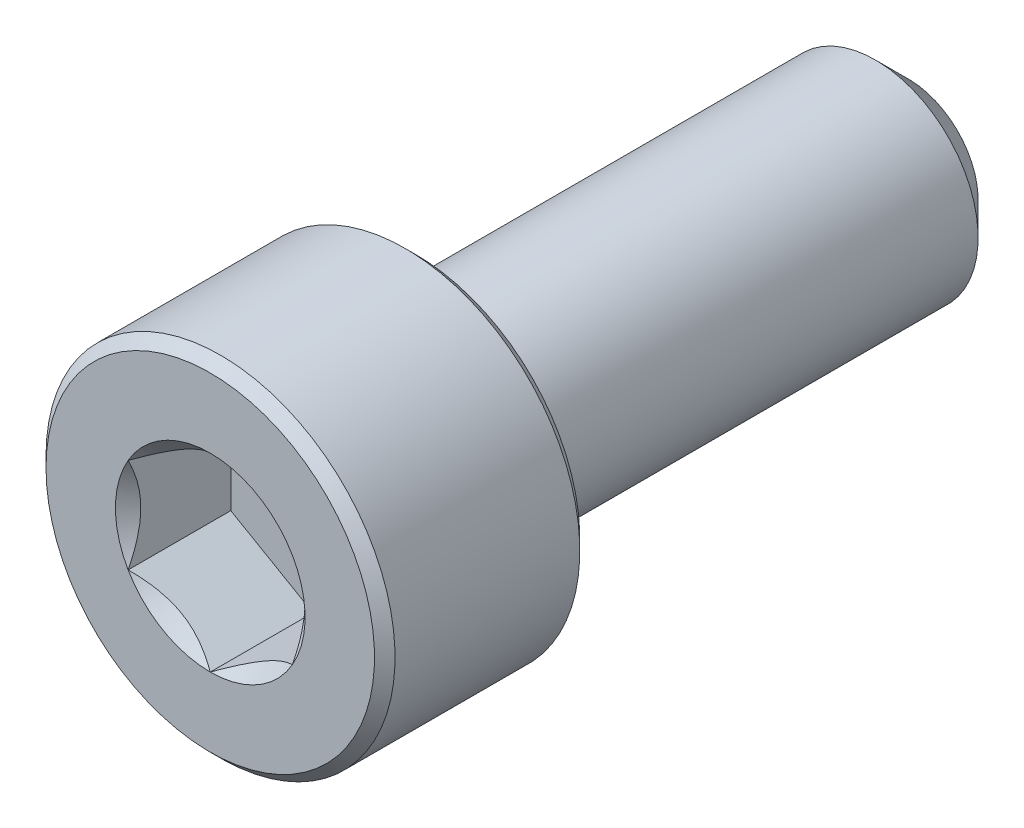
ISO-10303-21;
HEADER;
FILE_DESCRIPTION(('STEP AP214'),'2;1');
FILE_NAME('part.step','',(''),(''),'','','');
FILE_SCHEMA(('AUTOMOTIVE_DESIGN { 1 0 10303 214 1 1 1 1 }'));
ENDSEC;
DATA;
#1=APPLICATION_CONTEXT('core data for automotive mechanical design processes');
#2=APPLICATION_PROTOCOL_DEFINITION('international standard','automotive_design',2000,#1);
#3=PRODUCT_CONTEXT('',#1,'mechanical');
#4=PRODUCT('Part','Part','',(#3));
#5=PRODUCT_RELATED_PRODUCT_CATEGORY('part','',(#4));
#6=PRODUCT_DEFINITION_FORMATION('','',#4);
#7=PRODUCT_DEFINITION_CONTEXT('part definition',#1,'design');
#8=PRODUCT_DEFINITION('design','',#6,#7);
#9=PRODUCT_DEFINITION_SHAPE('','',#8);
#10=(LENGTH_UNIT() NAMED_UNIT(*) SI_UNIT(.MILLI.,.METRE.));
#11=(NAMED_UNIT(*) PLANE_ANGLE_UNIT() SI_UNIT($,.RADIAN.));
#12=(NAMED_UNIT(*) SI_UNIT($,.STERADIAN.) SOLID_ANGLE_UNIT());
#13=UNCERTAINTY_MEASURE_WITH_UNIT(LENGTH_MEASURE(1.E-05),#10,'distance_accuracy_value','');
#14=(GEOMETRIC_REPRESENTATION_CONTEXT(3) GLOBAL_UNCERTAINTY_ASSIGNED_CONTEXT((#13)) GLOBAL_UNIT_ASSIGNED_CONTEXT((#10,
#11,#12)) REPRESENTATION_CONTEXT('',''));
#15=CARTESIAN_POINT('',(0.,0.,0.));
#16=DIRECTION('',(0.,0.,1.));
#17=DIRECTION('',(1.,0.,0.));
#18=AXIS2_PLACEMENT_3D('',#15,#16,#17);
#19=CARTESIAN_POINT('',(0.,4.,8.5));
#20=DIRECTION('',(0.,0.,1.));
#21=DIRECTION('',(1.,0.,0.));
#22=AXIS2_PLACEMENT_3D('',#19,#20,#21);
#23=PLANE('',#22);
#24=CARTESIAN_POINT('',(0.,0.,8.5));
#25=DIRECTION('',(0.,0.,1.));
#26=DIRECTION('',(1.,0.,0.));
#27=AXIS2_PLACEMENT_3D('',#24,#25,#26);
#28=CIRCLE('',#27,2.3094010767585);
#29=CARTESIAN_POINT('',(2.,1.15470053837925,8.5));
#30=VERTEX_POINT('',#29);
#31=CARTESIAN_POINT('',(0.,2.3094010767585,8.5));
#32=VERTEX_POINT('',#31);
#33=EDGE_CURVE('E92',#30,#32,#28,.T.);
#34=ORIENTED_EDGE('',*,*,#33,.F.);
#35=CARTESIAN_POINT('',(2.,-1.15470053837925,8.5));
#36=VERTEX_POINT('',#35);
#37=EDGE_CURVE('E52',#36,#30,#28,.T.);
#38=ORIENTED_EDGE('',*,*,#37,.F.);
#39=CARTESIAN_POINT('',(0.,-2.3094010767585,8.5));
#40=VERTEX_POINT('',#39);
#41=EDGE_CURVE('E278',#40,#36,#28,.T.);
#42=ORIENTED_EDGE('',*,*,#41,.F.);
#43=CARTESIAN_POINT('',(-2.,-1.15470053837925,8.5));
#44=VERTEX_POINT('',#43);
#45=EDGE_CURVE('E59',#44,#40,#28,.T.);
#46=ORIENTED_EDGE('',*,*,#45,.F.);
#47=CARTESIAN_POINT('',(-2.,1.15470053837925,8.5));
#48=VERTEX_POINT('',#47);
#49=EDGE_CURVE('E128',#48,#44,#28,.T.);
#50=ORIENTED_EDGE('',*,*,#49,.F.);
#51=EDGE_CURVE('E101',#32,#48,#28,.T.);
#52=ORIENTED_EDGE('',*,*,#51,.F.);
#53=EDGE_LOOP('',(#34,#38,#42,#46,#50,#52));
#54=FACE_BOUND('',#53,.T.);
#55=CARTESIAN_POINT('',(0.,0.,8.5));
#56=DIRECTION('',(0.,0.,-1.));
#57=DIRECTION('',(-1.,0.,0.));
#58=AXIS2_PLACEMENT_3D('',#55,#56,#57);
#59=CIRCLE('',#58,4.);
#60=CARTESIAN_POINT('',(-4.,0.,8.5));
#61=VERTEX_POINT('',#60);
#62=EDGE_CURVE('E46',#61,#61,#59,.T.);
#63=ORIENTED_EDGE('',*,*,#62,.F.);
#64=EDGE_LOOP('',(#63));
#65=FACE_BOUND('',#64,.T.);
#66=ADVANCED_FACE('F33',(#54,#65),#23,.T.);
#67=CARTESIAN_POINT('',(0.,0.,8.25));
#68=DIRECTION('',(0.,0.,-1.));
#69=DIRECTION('',(-1.,0.,0.));
#70=AXIS2_PLACEMENT_3D('',#67,#68,#69);
#71=CONICAL_SURFACE('',#70,4.25,0.785398163397448);
#72=ORIENTED_EDGE('',*,*,#62,.T.);
#73=EDGE_LOOP('',(#72));
#74=FACE_BOUND('',#73,.T.);
#75=CARTESIAN_POINT('',(0.,0.,8.25));
#76=DIRECTION('',(0.,0.,-1.));
#77=DIRECTION('',(-1.,0.,0.));
#78=AXIS2_PLACEMENT_3D('',#75,#76,#77);
#79=CIRCLE('',#78,4.25);
#80=CARTESIAN_POINT('',(-4.25,0.,8.25));
#81=VERTEX_POINT('',#80);
#82=EDGE_CURVE('E212',#81,#81,#79,.T.);
#83=ORIENTED_EDGE('',*,*,#82,.F.);
#84=EDGE_LOOP('',(#83));
#85=FACE_BOUND('',#84,.T.);
#86=ADVANCED_FACE('F217',(#74,#85),#71,.T.);
#87=CARTESIAN_POINT('',(0.,0.,-8.5));
#88=DIRECTION('',(0.,0.,-1.));
#89=DIRECTION('',(-1.,0.,0.));
#90=AXIS2_PLACEMENT_3D('',#87,#88,#89);
#91=CYLINDRICAL_SURFACE('',#90,4.25);
#92=ORIENTED_EDGE('',*,*,#82,.T.);
#93=EDGE_LOOP('',(#92));
#94=FACE_BOUND('',#93,.T.);
#95=CARTESIAN_POINT('',(0.,0.,3.75));
#96=DIRECTION('',(0.,0.,-1.));
#97=DIRECTION('',(-1.,0.,0.));
#98=AXIS2_PLACEMENT_3D('',#95,#96,#97);
#99=CIRCLE('',#98,4.25);
#100=CARTESIAN_POINT('',(-4.25,0.,3.75));
#101=VERTEX_POINT('',#100);
#102=EDGE_CURVE('E209',#101,#101,#99,.T.);
#103=ORIENTED_EDGE('',*,*,#102,.F.);
#104=EDGE_LOOP('',(#103));
#105=FACE_BOUND('',#104,.T.);
#106=ADVANCED_FACE('F223',(#94,#105),#91,.T.);
#107=CARTESIAN_POINT('',(0.,0.,3.5));
#108=DIRECTION('',(0.,0.,1.));
#109=DIRECTION('',(1.,0.,0.));
#110=AXIS2_PLACEMENT_3D('',#107,#108,#109);
#111=CONICAL_SURFACE('',#110,4.,0.785398163397448);
#112=ORIENTED_EDGE('',*,*,#102,.T.);
#113=EDGE_LOOP('',(#112));
#114=FACE_BOUND('',#113,.T.);
#115=CARTESIAN_POINT('',(0.,0.,3.5));
#116=DIRECTION('',(0.,0.,-1.));
#117=DIRECTION('',(-1.,0.,0.));
#118=AXIS2_PLACEMENT_3D('',#115,#116,#117);
#119=CIRCLE('',#118,4.);
#120=CARTESIAN_POINT('',(-4.,0.,3.5));
#121=VERTEX_POINT('',#120);
#122=EDGE_CURVE('E206',#121,#121,#119,.T.);
#123=ORIENTED_EDGE('',*,*,#122,.F.);
#124=EDGE_LOOP('',(#123));
#125=FACE_BOUND('',#124,.T.);
#126=ADVANCED_FACE('F227',(#114,#125),#111,.T.);
#127=CARTESIAN_POINT('',(0.,4.,3.5));
#128=DIRECTION('',(0.,0.,-1.));
#129=DIRECTION('',(-1.,0.,0.));
#130=AXIS2_PLACEMENT_3D('',#127,#128,#129);
#131=PLANE('',#130);
#132=ORIENTED_EDGE('',*,*,#122,.T.);
#133=EDGE_LOOP('',(#132));
#134=FACE_BOUND('',#133,.T.);
#135=CARTESIAN_POINT('',(0.,0.,3.5));
#136=DIRECTION('',(0.,0.,-1.));
#137=DIRECTION('',(-1.,0.,0.));
#138=AXIS2_PLACEMENT_3D('',#135,#136,#137);
#139=CIRCLE('',#138,2.5);
#140=CARTESIAN_POINT('',(-2.5,0.,3.5));
#141=VERTEX_POINT('',#140);
#142=EDGE_CURVE('E203',#141,#141,#139,.T.);
#143=ORIENTED_EDGE('',*,*,#142,.F.);
#144=EDGE_LOOP('',(#143));
#145=FACE_BOUND('',#144,.T.);
#146=ADVANCED_FACE('F233',(#134,#145),#131,.T.);
#147=CARTESIAN_POINT('',(0.,0.,-8.5));
#148=DIRECTION('',(0.,0.,-1.));
#149=DIRECTION('',(-1.,0.,0.));
#150=AXIS2_PLACEMENT_3D('',#147,#148,#149);
#151=CYLINDRICAL_SURFACE('',#150,2.5);
#152=ORIENTED_EDGE('',*,*,#142,.T.);
#153=EDGE_LOOP('',(#152));
#154=FACE_BOUND('',#153,.T.);
#155=CARTESIAN_POINT('',(0.,0.,-7.69999999999999));
#156=DIRECTION('',(0.,0.,-1.));
#157=DIRECTION('',(-1.,0.,0.));
#158=AXIS2_PLACEMENT_3D('',#155,#156,#157);
#159=CIRCLE('',#158,2.5);
#160=CARTESIAN_POINT('',(-2.5,0.,-7.69999999999999));
#161=VERTEX_POINT('',#160);
#162=EDGE_CURVE('E200',#161,#161,#159,.T.);
#163=ORIENTED_EDGE('',*,*,#162,.F.);
#164=EDGE_LOOP('',(#163));
#165=FACE_BOUND('',#164,.T.);
#166=ADVANCED_FACE('F237',(#154,#165),#151,.T.);
#167=CARTESIAN_POINT('',(0.,0.,-8.5));
#168=DIRECTION('',(0.,0.,1.));
#169=DIRECTION('',(1.,0.,0.));
#170=AXIS2_PLACEMENT_3D('',#167,#168,#169);
#171=CONICAL_SURFACE('',#170,1.7,0.785398163397444);
#172=ORIENTED_EDGE('',*,*,#162,.T.);
#173=EDGE_LOOP('',(#172));
#174=FACE_BOUND('',#173,.T.);
#175=CARTESIAN_POINT('',(0.,0.,-8.5));
#176=DIRECTION('',(0.,0.,-1.));
#177=DIRECTION('',(-1.,0.,0.));
#178=AXIS2_PLACEMENT_3D('',#175,#176,#177);
#179=CIRCLE('',#178,1.7);
#180=CARTESIAN_POINT('',(-1.7,0.,-8.5));
#181=VERTEX_POINT('',#180);
#182=EDGE_CURVE('E188',#181,#181,#179,.T.);
#183=ORIENTED_EDGE('',*,*,#182,.F.);
#184=EDGE_LOOP('',(#183));
#185=FACE_BOUND('',#184,.T.);
#186=ADVANCED_FACE('F240',(#174,#185),#171,.T.);
#187=CARTESIAN_POINT('',(0.,1.7,-8.5));
#188=DIRECTION('',(0.,0.,-1.));
#189=DIRECTION('',(-1.,0.,0.));
#190=AXIS2_PLACEMENT_3D('',#187,#188,#189);
#191=PLANE('',#190);
#192=ORIENTED_EDGE('',*,*,#182,.T.);
#193=EDGE_LOOP('',(#192));
#194=FACE_BOUND('',#193,.T.);
#195=ADVANCED_FACE('F161',(#194),#191,.T.);
#196=CARTESIAN_POINT('',(0.,0.,8.5));
#197=DIRECTION('',(0.,0.,1.));
#198=DIRECTION('',(1.,0.,0.));
#199=AXIS2_PLACEMENT_3D('',#196,#197,#198);
#200=CONICAL_SURFACE('',#199,2.3094010767585,0.78539816339745);
#201=ORIENTED_EDGE('',*,*,#51,.T.);
#202=CARTESIAN_POINT('',(0.000200000000000219,2.30951654681234,8.50011547871366));
#203=CARTESIAN_POINT('',(-0.0685530340307051,2.26982196410711,8.46045309022559));
#204=CARTESIAN_POINT('',(-0.138455742135511,2.22946361676572,8.42311998228416));
#205=CARTESIAN_POINT('',(-0.280995244550436,2.14716839667631,8.35476368513615));
#206=CARTESIAN_POINT('',(-0.353645597565358,2.10522369580642,8.32377853373722));
#207=CARTESIAN_POINT('',(-0.500141601053971,2.02064418875706,8.27070021654414));
#208=CARTESIAN_POINT('',(-0.573949935246294,1.97803092714269,8.24847362717661));
#209=CARTESIAN_POINT('',(-0.723191631835264,1.89186619344273,8.21422881667508));
#210=CARTESIAN_POINT('',(-0.798620433918152,1.84831735425552,8.20218502914414));
#211=CARTESIAN_POINT('',(-0.928615500671079,1.7732646674724,8.19131851190557));
#212=CARTESIAN_POINT('',(-0.983013783970109,1.74185780396625,8.18970975360997));
#213=CARTESIAN_POINT('',(-1.09172145551969,1.67909540053412,8.19241887759871));
#214=CARTESIAN_POINT('',(-1.14603080592134,1.64773988246022,8.19673883775798));
#215=CARTESIAN_POINT('',(-1.25413672758934,1.5853248994842,8.21105956740991));
#216=CARTESIAN_POINT('',(-1.30793265655479,1.55426580541469,8.22106669276201));
#217=CARTESIAN_POINT('',(-1.41459426230557,1.49268469862228,8.24621243024966));
#218=CARTESIAN_POINT('',(-1.46746001007071,1.46216264491917,8.26135064904224));
#219=CARTESIAN_POINT('',(-1.60287973308984,1.38397803138049,8.30629450342919));
#220=CARTESIAN_POINT('',(-1.68459383484948,1.33680037273297,8.33948883942582));
#221=CARTESIAN_POINT('',(-1.8047470372578,1.26742988897853,8.39552582317137));
#222=CARTESIAN_POINT('',(-1.84434285210918,1.24456923461531,8.41521470294694));
#223=CARTESIAN_POINT('',(-1.92280095888787,1.19927142554652,8.45638731836487));
#224=CARTESIAN_POINT('',(-1.96166368359374,1.17683402097614,8.47786995165125));
#225=CARTESIAN_POINT('',(-2.0002,1.15458506832541,8.50011547871366));
#226=B_SPLINE_CURVE_WITH_KNOTS('',3,(#202,#203,#204,#205,#206,#207,#208,#209,#210,#211,#212,
#213,#214,#215,#216,#217,#218,#219,#220,#221,#222,#223,#224,#225),.UNSPECIFIED.,.F.,.F.,(4,2,2,
2,2,2,2,2,2,2,2,4),(0.,0.266420613771063,0.534393751523388,0.798110374376914,1.06116288956936,
1.24939906803722,1.43770123566247,1.62621426093932,1.81471283831913,2.11415604834145,
2.26347170717791,2.41269626969771),.UNSPECIFIED.);
#227=EDGE_CURVE('E11',#32,#48,#226,.T.);
#228=ORIENTED_EDGE('',*,*,#227,.F.);
#229=EDGE_LOOP('',(#201,#228));
#230=FACE_BOUND('',#229,.T.);
#231=ADVANCED_FACE('F105',(#230),#200,.F.);
#232=ORIENTED_EDGE('',*,*,#49,.T.);
#233=CARTESIAN_POINT('',(-2.,-2.33350792809314,9.26391297333034));
#234=CARTESIAN_POINT('',(-2.,-2.27682524005105,9.22088465819452));
#235=CARTESIAN_POINT('',(-2.,-2.21982863127677,9.17826321968666));
#236=CARTESIAN_POINT('',(-2.,-2.10508243227164,9.09401735382318));
#237=CARTESIAN_POINT('',(-2.,-2.04733265969732,9.05239317509694));
#238=CARTESIAN_POINT('',(-2.,-1.9305325076875,8.97002893909808));
#239=CARTESIAN_POINT('',(-2.,-1.87147552066419,8.929298220564));
#240=CARTESIAN_POINT('',(-2.,-1.75236453496771,8.84932648957119));
#241=CARTESIAN_POINT('',(-2.,-1.69231060660119,8.81008537269831));
#242=CARTESIAN_POINT('',(-2.,-1.567471533448,8.73116787888498));
#243=CARTESIAN_POINT('',(-2.,-1.50261611656329,8.69160210237478));
#244=CARTESIAN_POINT('',(-2.,-1.37138716901082,8.61502921587276));
#245=CARTESIAN_POINT('',(-2.,-1.30501336962871,8.57802256351504));
#246=CARTESIAN_POINT('',(-2.,-1.17075263037878,8.50736673923407));
#247=CARTESIAN_POINT('',(-2.,-1.10287104348427,8.47370747514608));
#248=CARTESIAN_POINT('',(-2.,-0.96522809254686,8.41049315112672));
#249=CARTESIAN_POINT('',(-2.,-0.895467367515904,8.38093671652697));
#250=CARTESIAN_POINT('',(-2.,-0.760038155655726,8.32931025785436));
#251=CARTESIAN_POINT('',(-2.,-0.694533426178474,8.30681508107925));
#252=CARTESIAN_POINT('',(-2.,-0.561920164972267,8.26707588844303));
#253=CARTESIAN_POINT('',(-2.,-0.494811525645963,8.24983222594906));
#254=CARTESIAN_POINT('',(-2.,-0.360522211095495,8.22179275650282));
#255=CARTESIAN_POINT('',(-2.,-0.293365389163158,8.21088458822735));
#256=CARTESIAN_POINT('',(-2.,-0.15830009002928,8.19573270261191));
#257=CARTESIAN_POINT('',(-2.,-0.0903917516002775,8.19148777487641));
#258=CARTESIAN_POINT('',(-2.,0.0429020652606311,8.18999114215311));
#259=CARTESIAN_POINT('',(-2.,0.108284684169079,8.1924781450741));
#260=CARTESIAN_POINT('',(-2.,0.23850440969295,8.20372439320255));
#261=CARTESIAN_POINT('',(-2.,0.303341463641696,8.21248423709365));
#262=CARTESIAN_POINT('',(-2.,0.433098840648744,8.23594152298035));
#263=CARTESIAN_POINT('',(-2.,0.498000415627631,8.25074108464347));
#264=CARTESIAN_POINT('',(-2.,0.626381661351717,8.28548203883061));
#265=CARTESIAN_POINT('',(-2.,0.689861439952175,8.3054230398874));
#266=CARTESIAN_POINT('',(-2.,0.888345745687483,8.37531214536041));
#267=CARTESIAN_POINT('',(-2.,1.02055912670982,8.4331624710628));
#268=CARTESIAN_POINT('',(-2.,1.27879697777602,8.56182319594991));
#269=CARTESIAN_POINT('',(-2.,1.40479723810913,8.63267988107336));
#270=CARTESIAN_POINT('',(-2.,1.58692013279987,8.74327963632549));
#271=CARTESIAN_POINT('',(-2.,1.64501521895223,8.77983824352554));
#272=CARTESIAN_POINT('',(-2.,1.76020814703229,8.85450591449783));
#273=CARTESIAN_POINT('',(-2.,1.81730591318335,8.8926150953569));
#274=CARTESIAN_POINT('',(-2.,1.93017247334117,8.96978646473081));
#275=CARTESIAN_POINT('',(-2.,1.98594828328331,9.00883844345984));
#276=CARTESIAN_POINT('',(-2.,2.09673667795809,9.08797979648984));
#277=CARTESIAN_POINT('',(-2.,2.15174946854704,9.1280688822828));
#278=CARTESIAN_POINT('',(-2.,2.20644261038878,9.16858297171107));
#279=B_SPLINE_CURVE_WITH_KNOTS('',3,(#233,#234,#235,#236,#237,#238,#239,#240,#241,#242,#243,
#244,#245,#246,#247,#248,#249,#250,#251,#252,#253,#254,#255,#256,#257,#258,#259,#260,#261,#262,
#263,#264,#265,#266,#267,#268,#269,#270,#271,#272,#273,#274,#275,#276,#277,#278),.UNSPECIFIED.,
.F.,.F.,(4,2,2,2,2,2,2,2,2,2,2,2,2,2,2,2,2,2,2,2,2,2,4),(0.,0.213497148294752,0.427046981593393,
0.642249974749847,0.857437855216921,1.08530552050929,1.31321382930987,1.54041273599371,
1.76753533413947,1.97513287362836,2.18274437898411,2.38655158594355,2.59032176649044,
2.78629737352115,2.98229168707252,3.18174703964799,3.38118721025193,3.81287365989454,
4.24612724012856,4.45203046308783,4.65794926316182,4.86220142187746,5.06639735899165),.UNSPECIFIED.);
#280=EDGE_CURVE('E100',#48,#44,#279,.F.);
#281=ORIENTED_EDGE('',*,*,#280,.F.);
#282=EDGE_LOOP('',(#232,#281));
#283=FACE_BOUND('',#282,.T.);
#284=ADVANCED_FACE('F255',(#283),#200,.F.);
#285=ORIENTED_EDGE('',*,*,#45,.T.);
#286=CARTESIAN_POINT('',(-2.0002,-1.15458506832541,8.50011547871366));
#287=CARTESIAN_POINT('',(-1.93144696596929,-1.19427965103065,8.46045309022559));
#288=CARTESIAN_POINT('',(-1.86154425786449,-1.23463799837204,8.42311998228416));
#289=CARTESIAN_POINT('',(-1.71900475544956,-1.31693321846145,8.35476368513614));
#290=CARTESIAN_POINT('',(-1.64635440243464,-1.35887791933134,8.32377853373722));
#291=CARTESIAN_POINT('',(-1.49985839894603,-1.44345742638069,8.27070021654414));
#292=CARTESIAN_POINT('',(-1.42605006475371,-1.48607068799507,8.24847362717661));
#293=CARTESIAN_POINT('',(-1.27680836816474,-1.57223542169503,8.21422881667508));
#294=CARTESIAN_POINT('',(-1.20137956608185,-1.61578426088223,8.20218502914414));
#295=CARTESIAN_POINT('',(-1.07138449932892,-1.69083694766536,8.19131851190557));
#296=CARTESIAN_POINT('',(-1.01698621602989,-1.72224381117151,8.18970975360997));
#297=CARTESIAN_POINT('',(-0.908278544480307,-1.78500621460364,8.19241887759871));
#298=CARTESIAN_POINT('',(-0.853969194078662,-1.81636173267754,8.19673883775797));
#299=CARTESIAN_POINT('',(-0.745863272410663,-1.87877671565355,8.21105956740991));
#300=CARTESIAN_POINT('',(-0.692067343445209,-1.90983580972306,8.22106669276201));
#301=CARTESIAN_POINT('',(-0.585405737694427,-1.97141691651547,8.24621243024966));
#302=CARTESIAN_POINT('',(-0.532539989929288,-2.00193897021859,8.26135064904224));
#303=CARTESIAN_POINT('',(-0.397120266910157,-2.08012358375727,8.30629450342919));
#304=CARTESIAN_POINT('',(-0.315406165150523,-2.12730124240478,8.33948883942582));
#305=CARTESIAN_POINT('',(-0.195252962742199,-2.19667172615922,8.39552582317137));
#306=CARTESIAN_POINT('',(-0.155657147890825,-2.21953238052245,8.41521470294694));
#307=CARTESIAN_POINT('',(-0.0771990411121298,-2.26483018959124,8.45638731836487));
#308=CARTESIAN_POINT('',(-0.0383363164062618,-2.28726759416161,8.47786995165125));
#309=CARTESIAN_POINT('',(0.000199999999997879,-2.30951654681234,8.50011547871366));
#310=B_SPLINE_CURVE_WITH_KNOTS('',3,(#286,#287,#288,#289,#290,#291,#292,#293,#294,#295,#296,
#297,#298,#299,#300,#301,#302,#303,#304,#305,#306,#307,#308,#309),.UNSPECIFIED.,.F.,.F.,(4,2,2,
2,2,2,2,2,2,2,2,4),(0.,0.266420613771063,0.534393751523389,0.798110374376913,1.06116288956936,
1.24939906803722,1.43770123566247,1.62621426093932,1.81471283831913,2.11415604834145,
2.2634717071779,2.41269626969771),.UNSPECIFIED.);
#311=EDGE_CURVE('E137',#44,#40,#310,.T.);
#312=ORIENTED_EDGE('',*,*,#311,.F.);
#313=EDGE_LOOP('',(#285,#312));
#314=FACE_BOUND('',#313,.T.);
#315=ADVANCED_FACE('F259',(#314),#200,.F.);
#316=ORIENTED_EDGE('',*,*,#41,.T.);
#317=CARTESIAN_POINT('',(-0.000200000000001455,-2.30951654681234,8.50011547871366));
#318=CARTESIAN_POINT('',(0.0685530340307037,-2.26982196410711,8.46045309022559));
#319=CARTESIAN_POINT('',(0.13845574213551,-2.22946361676572,8.42311998228416));
#320=CARTESIAN_POINT('',(0.280995244550434,-2.1471683966763,8.35476368513614));
#321=CARTESIAN_POINT('',(0.353645597565356,-2.10522369580642,8.32377853373722));
#322=CARTESIAN_POINT('',(0.50014160105397,-2.02064418875706,8.27070021654414));
#323=CARTESIAN_POINT('',(0.573949935246293,-1.97803092714269,8.24847362717661));
#324=CARTESIAN_POINT('',(0.723191631835263,-1.89186619344273,8.21422881667508));
#325=CARTESIAN_POINT('',(0.798620433918151,-1.84831735425552,8.20218502914414));
#326=CARTESIAN_POINT('',(0.928615500671078,-1.7732646674724,8.19131851190557));
#327=CARTESIAN_POINT('',(0.983013783970107,-1.74185780396625,8.18970975360997));
#328=CARTESIAN_POINT('',(1.09172145551969,-1.67909540053412,8.19241887759871));
#329=CARTESIAN_POINT('',(1.14603080592134,-1.64773988246021,8.19673883775797));
#330=CARTESIAN_POINT('',(1.25413672758934,-1.5853248994842,8.2110595674099));
#331=CARTESIAN_POINT('',(1.30793265655479,-1.55426580541469,8.22106669276201));
#332=CARTESIAN_POINT('',(1.41459426230557,-1.49268469862228,8.24621243024966));
#333=CARTESIAN_POINT('',(1.46746001007071,-1.46216264491917,8.26135064904224));
#334=CARTESIAN_POINT('',(1.60287973308984,-1.38397803138049,8.30629450342919));
#335=CARTESIAN_POINT('',(1.68459383484948,-1.33680037273297,8.33948883942582));
#336=CARTESIAN_POINT('',(1.8047470372578,-1.26742988897853,8.39552582317137));
#337=CARTESIAN_POINT('',(1.84434285210918,-1.24456923461531,8.41521470294694));
#338=CARTESIAN_POINT('',(1.92280095888787,-1.19927142554652,8.45638731836487));
#339=CARTESIAN_POINT('',(1.96166368359374,-1.17683402097614,8.47786995165125));
#340=CARTESIAN_POINT('',(2.0002,-1.15458506832541,8.50011547871366));
#341=B_SPLINE_CURVE_WITH_KNOTS('',3,(#317,#318,#319,#320,#321,#322,#323,#324,#325,#326,#327,
#328,#329,#330,#331,#332,#333,#334,#335,#336,#337,#338,#339,#340),.UNSPECIFIED.,.F.,.F.,(4,2,2,
2,2,2,2,2,2,2,2,4),(0.,0.266420613771063,0.534393751523388,0.798110374376914,1.06116288956936,
1.24939906803722,1.43770123566247,1.62621426093932,1.81471283831913,2.11415604834145,
2.2634717071779,2.41269626969771),.UNSPECIFIED.);
#342=EDGE_CURVE('E280',#40,#36,#341,.T.);
#343=ORIENTED_EDGE('',*,*,#342,.F.);
#344=EDGE_LOOP('',(#316,#343));
#345=FACE_BOUND('',#344,.T.);
#346=ADVANCED_FACE('F268',(#345),#200,.F.);
#347=ORIENTED_EDGE('',*,*,#37,.T.);
#348=CARTESIAN_POINT('',(2.,-2.3335079282084,9.26391297341786));
#349=CARTESIAN_POINT('',(2.,-2.27682524016305,9.22088465827867));
#350=CARTESIAN_POINT('',(2.,-2.21982863138551,9.17826321976744));
#351=CARTESIAN_POINT('',(2.,-2.1050824323738,9.09401735389723));
#352=CARTESIAN_POINT('',(2.,-2.04733265979617,9.05239317516764));
#353=CARTESIAN_POINT('',(2.,-1.93053250777963,8.97002893916205));
#354=CARTESIAN_POINT('',(2.,-1.8714755207529,8.9292982206246));
#355=CARTESIAN_POINT('',(2.,-1.75236453504953,8.84932648962509));
#356=CARTESIAN_POINT('',(2.,-1.69231060667954,8.81008537274889));
#357=CARTESIAN_POINT('',(2.,-1.56747153351884,8.73116787892864));
#358=CARTESIAN_POINT('',(2.,-1.5026161166301,8.69160210241486));
#359=CARTESIAN_POINT('',(2.,-1.37138716906941,8.61502921590585));
#360=CARTESIAN_POINT('',(2.,-1.30501336968313,8.57802256354471));
#361=CARTESIAN_POINT('',(2.,-1.17075263042469,8.50736673925719));
#362=CARTESIAN_POINT('',(2.,-1.10287104352586,8.47370747516608));
#363=CARTESIAN_POINT('',(2.,-0.965228092579559,8.41049315114084));
#364=CARTESIAN_POINT('',(2.,-0.895467367544042,8.38093671653835));
#365=CARTESIAN_POINT('',(2.,-0.760038155681911,8.32931025786375));
#366=CARTESIAN_POINT('',(2.,-0.694533426207471,8.30681508108886));
#367=CARTESIAN_POINT('',(2.,-0.561920165006982,8.26707588845251));
#368=CARTESIAN_POINT('',(2.,-0.494811525683585,8.2498322259582));
#369=CARTESIAN_POINT('',(2.,-0.360522211138837,8.22179275651061));
#370=CARTESIAN_POINT('',(2.,-0.293365389209312,8.21088458823415));
#371=CARTESIAN_POINT('',(2.,-0.15830009008097,8.19573270261609));
#372=CARTESIAN_POINT('',(2.,-0.0903917516546917,8.19148777487896));
#373=CARTESIAN_POINT('',(2.,0.0429020652013076,8.18999114215191));
#374=CARTESIAN_POINT('',(2.,0.108284684107563,8.19247814507083));
#375=CARTESIAN_POINT('',(2.,0.238504409627276,8.20372439319483));
#376=CARTESIAN_POINT('',(2.,0.303341463574055,8.21248423708354));
#377=CARTESIAN_POINT('',(2.,0.433098840577223,8.23594152296526));
#378=CARTESIAN_POINT('',(2.,0.498000415554201,8.25074108462575));
#379=CARTESIAN_POINT('',(2.,0.626381661274659,8.2854820388076));
#380=CARTESIAN_POINT('',(2.,0.689861439873398,8.30542303986172));
#381=CARTESIAN_POINT('',(2.,0.888345745591677,8.3753121453222));
#382=CARTESIAN_POINT('',(2.,1.02055912659956,8.43316247101307));
#383=CARTESIAN_POINT('',(2.,1.27879697763796,8.56182319587588));
#384=CARTESIAN_POINT('',(2.,1.40479723795773,8.63267988098653));
#385=CARTESIAN_POINT('',(2.,1.58692013262996,8.74327963621991));
#386=CARTESIAN_POINT('',(2.,1.64501521877692,8.7798382434142));
#387=CARTESIAN_POINT('',(2.,1.76020814684622,8.85450591437492));
#388=CARTESIAN_POINT('',(2.,1.81730591299196,8.8926150952282));
#389=CARTESIAN_POINT('',(2.,1.93017247313923,8.96978646459059));
#390=CARTESIAN_POINT('',(2.,1.98594828307617,9.0088384433139));
#391=CARTESIAN_POINT('',(2.,2.09673667774057,9.08797979633245));
#392=CARTESIAN_POINT('',(2.,2.15174946832435,9.1280688821197));
#393=CARTESIAN_POINT('',(2.,2.20644261016092,9.16858297154225));
#394=B_SPLINE_CURVE_WITH_KNOTS('',3,(#348,#349,#350,#351,#352,#353,#354,#355,#356,#357,#358,
#359,#360,#361,#362,#363,#364,#365,#366,#367,#368,#369,#370,#371,#372,#373,#374,#375,#376,#377,
#378,#379,#380,#381,#382,#383,#384,#385,#386,#387,#388,#389,#390,#391,#392,#393),.UNSPECIFIED.,
.F.,.F.,(4,2,2,2,2,2,2,2,2,2,2,2,2,2,2,2,2,2,2,2,2,2,4),(0.,0.21349714830867,0.427046981621236,
0.642249974791875,0.85743785527313,1.08530552058142,1.31321382939793,1.54041273609756,
1.76753533425909,1.97513287373982,2.18274437908743,2.38655158603907,2.59032176657815,
2.78629737360208,2.98229168714667,3.18174703971481,3.38118721031143,3.81287365990069,
4.24612724008101,4.45203046301732,4.65794926306836,4.86220142176135,5.06639735885289),.UNSPECIFIED.);
#395=EDGE_CURVE('E117',#36,#30,#394,.T.);
#396=ORIENTED_EDGE('',*,*,#395,.F.);
#397=EDGE_LOOP('',(#347,#396));
#398=FACE_BOUND('',#397,.T.);
#399=ADVANCED_FACE('F262',(#398),#200,.F.);
#400=ORIENTED_EDGE('',*,*,#33,.T.);
#401=CARTESIAN_POINT('',(2.0002,1.15458506832542,8.50011547871366));
#402=CARTESIAN_POINT('',(1.93144696596929,1.19427965103065,8.46045309022559));
#403=CARTESIAN_POINT('',(1.86154425786449,1.23463799837204,8.42311998228416));
#404=CARTESIAN_POINT('',(1.71900475544956,1.31693321846145,8.35476368513614));
#405=CARTESIAN_POINT('',(1.64635440243464,1.35887791933134,8.32377853373722));
#406=CARTESIAN_POINT('',(1.49985839894603,1.44345742638069,8.27070021654414));
#407=CARTESIAN_POINT('',(1.4260500647537,1.48607068799507,8.24847362717661));
#408=CARTESIAN_POINT('',(1.27680836816473,1.57223542169503,8.21422881667508));
#409=CARTESIAN_POINT('',(1.20137956608185,1.61578426088223,8.20218502914414));
#410=CARTESIAN_POINT('',(1.07138449932892,1.69083694766536,8.19131851190557));
#411=CARTESIAN_POINT('',(1.01698621602989,1.72224381117151,8.18970975360997));
#412=CARTESIAN_POINT('',(0.908278544480304,1.78500621460364,8.19241887759871));
#413=CARTESIAN_POINT('',(0.853969194078658,1.81636173267754,8.19673883775798));
#414=CARTESIAN_POINT('',(0.745863272410659,1.87877671565355,8.21105956740991));
#415=CARTESIAN_POINT('',(0.692067343445205,1.90983580972307,8.22106669276201));
#416=CARTESIAN_POINT('',(0.585405737694424,1.97141691651548,8.24621243024966));
#417=CARTESIAN_POINT('',(0.532539989929285,2.00193897021859,8.26135064904224));
#418=CARTESIAN_POINT('',(0.397120266910153,2.08012358375727,8.30629450342919));
#419=CARTESIAN_POINT('',(0.315406165150519,2.12730124240478,8.33948883942582));
#420=CARTESIAN_POINT('',(0.195252962742197,2.19667172615922,8.39552582317137));
#421=CARTESIAN_POINT('',(0.155657147890823,2.21953238052245,8.41521470294694));
#422=CARTESIAN_POINT('',(0.0771990411121282,2.26483018959124,8.45638731836487));
#423=CARTESIAN_POINT('',(0.03833631640626,2.28726759416161,8.47786995165125));
#424=CARTESIAN_POINT('',(-0.000199999999999808,2.30951654681234,8.50011547871366));
#425=B_SPLINE_CURVE_WITH_KNOTS('',3,(#401,#402,#403,#404,#405,#406,#407,#408,#409,#410,#411,
#412,#413,#414,#415,#416,#417,#418,#419,#420,#421,#422,#423,#424),.UNSPECIFIED.,.F.,.F.,(4,2,2,
2,2,2,2,2,2,2,2,4),(0.,0.266420613771063,0.534393751523389,0.798110374376915,1.06116288956936,
1.24939906803722,1.43770123566248,1.62621426093932,1.81471283831913,2.11415604834145,
2.2634717071779,2.41269626969771),.UNSPECIFIED.);
#426=EDGE_CURVE('E96',#30,#32,#425,.T.);
#427=ORIENTED_EDGE('',*,*,#426,.F.);
#428=EDGE_LOOP('',(#400,#427));
#429=FACE_BOUND('',#428,.T.);
#430=ADVANCED_FACE('F94',(#429),#200,.F.);
#431=CARTESIAN_POINT('',(0.,0.,6.));
#432=DIRECTION('',(0.,0.,1.));
#433=DIRECTION('',(1.,0.,0.));
#434=AXIS2_PLACEMENT_3D('',#431,#432,#433);
#435=PLANE('',#434);
#436=DIRECTION('',(-0.866025403784439,0.5,0.));
#437=VECTOR('',#436,1.);
#438=CARTESIAN_POINT('',(2.,1.15470053837925,6.));
#439=LINE('',#438,#437);
#440=CARTESIAN_POINT('',(2.,1.15470053837925,6.));
#441=VERTEX_POINT('',#440);
#442=CARTESIAN_POINT('',(0.,2.3094010767585,6.));
#443=VERTEX_POINT('',#442);
#444=EDGE_CURVE('E116',#441,#443,#439,.T.);
#445=ORIENTED_EDGE('',*,*,#444,.T.);
#446=DIRECTION('',(-0.866025403784439,-0.5,0.));
#447=VECTOR('',#446,1.);
#448=CARTESIAN_POINT('',(0.,2.3094010767585,6.));
#449=LINE('',#448,#447);
#450=CARTESIAN_POINT('',(-2.,1.15470053837925,6.));
#451=VERTEX_POINT('',#450);
#452=EDGE_CURVE('E121',#443,#451,#449,.T.);
#453=ORIENTED_EDGE('',*,*,#452,.T.);
#454=DIRECTION('',(0.,-1.,0.));
#455=VECTOR('',#454,1.);
#456=CARTESIAN_POINT('',(-2.,1.15470053837925,6.));
#457=LINE('',#456,#455);
#458=CARTESIAN_POINT('',(-2.,-1.15470053837925,6.));
#459=VERTEX_POINT('',#458);
#460=EDGE_CURVE('E176',#451,#459,#457,.T.);
#461=ORIENTED_EDGE('',*,*,#460,.T.);
#462=DIRECTION('',(0.866025403784439,-0.5,0.));
#463=VECTOR('',#462,1.);
#464=CARTESIAN_POINT('',(-2.,-1.15470053837925,6.));
#465=LINE('',#464,#463);
#466=CARTESIAN_POINT('',(0.,-2.3094010767585,6.));
#467=VERTEX_POINT('',#466);
#468=EDGE_CURVE('E179',#459,#467,#465,.T.);
#469=ORIENTED_EDGE('',*,*,#468,.T.);
#470=DIRECTION('',(0.866025403784439,0.5,0.));
#471=VECTOR('',#470,1.);
#472=CARTESIAN_POINT('',(0.,-2.3094010767585,6.));
#473=LINE('',#472,#471);
#474=CARTESIAN_POINT('',(2.,-1.15470053837925,6.));
#475=VERTEX_POINT('',#474);
#476=EDGE_CURVE('E182',#467,#475,#473,.T.);
#477=ORIENTED_EDGE('',*,*,#476,.T.);
#478=DIRECTION('',(0.,1.,0.));
#479=VECTOR('',#478,1.);
#480=CARTESIAN_POINT('',(2.,-1.15470053837925,6.));
#481=LINE('',#480,#479);
#482=EDGE_CURVE('E124',#475,#441,#481,.T.);
#483=ORIENTED_EDGE('',*,*,#482,.T.);
#484=EDGE_LOOP('',(#445,#453,#461,#469,#477,#483));
#485=FACE_BOUND('',#484,.T.);
#486=ADVANCED_FACE('F156',(#485),#435,.T.);
#487=CARTESIAN_POINT('',(0.,2.3094010767585,6.));
#488=DIRECTION('',(-0.5,0.866025403784439,0.));
#489=DIRECTION('',(-0.866025403784439,-0.5,0.));
#490=AXIS2_PLACEMENT_3D('',#487,#488,#489);
#491=PLANE('',#490);
#492=DIRECTION('',(0.,0.,1.));
#493=VECTOR('',#492,1.);
#494=CARTESIAN_POINT('',(0.,2.3094010767585,6.));
#495=LINE('',#494,#493);
#496=EDGE_CURVE('E113',#443,#32,#495,.T.);
#497=ORIENTED_EDGE('',*,*,#496,.T.);
#498=ORIENTED_EDGE('',*,*,#227,.T.);
#499=DIRECTION('',(0.,0.,1.));
#500=VECTOR('',#499,1.);
#501=CARTESIAN_POINT('',(-2.,1.15470053837925,6.));
#502=LINE('',#501,#500);
#503=EDGE_CURVE('E123',#451,#48,#502,.T.);
#504=ORIENTED_EDGE('',*,*,#503,.F.);
#505=ORIENTED_EDGE('',*,*,#452,.F.);
#506=EDGE_LOOP('',(#497,#498,#504,#505));
#507=FACE_BOUND('',#506,.T.);
#508=ADVANCED_FACE('F119',(#507),#491,.F.);
#509=CARTESIAN_POINT('',(-2.,1.15470053837925,6.));
#510=DIRECTION('',(-1.,0.,0.));
#511=DIRECTION('',(0.,-1.,0.));
#512=AXIS2_PLACEMENT_3D('',#509,#510,#511);
#513=PLANE('',#512);
#514=ORIENTED_EDGE('',*,*,#503,.T.);
#515=ORIENTED_EDGE('',*,*,#280,.T.);
#516=DIRECTION('',(0.,0.,1.));
#517=VECTOR('',#516,1.);
#518=CARTESIAN_POINT('',(-2.,-1.15470053837925,6.));
#519=LINE('',#518,#517);
#520=EDGE_CURVE('E194',#459,#44,#519,.T.);
#521=ORIENTED_EDGE('',*,*,#520,.F.);
#522=ORIENTED_EDGE('',*,*,#460,.F.);
#523=EDGE_LOOP('',(#514,#515,#521,#522));
#524=FACE_BOUND('',#523,.T.);
#525=ADVANCED_FACE('F146',(#524),#513,.F.);
#526=CARTESIAN_POINT('',(-2.,-1.15470053837925,6.));
#527=DIRECTION('',(-0.5,-0.866025403784438,0.));
#528=DIRECTION('',(0.866025403784439,-0.5,0.));
#529=AXIS2_PLACEMENT_3D('',#526,#527,#528);
#530=PLANE('',#529);
#531=ORIENTED_EDGE('',*,*,#520,.T.);
#532=ORIENTED_EDGE('',*,*,#311,.T.);
#533=DIRECTION('',(0.,0.,1.));
#534=VECTOR('',#533,1.);
#535=CARTESIAN_POINT('',(0.,-2.3094010767585,6.));
#536=LINE('',#535,#534);
#537=EDGE_CURVE('E191',#467,#40,#536,.T.);
#538=ORIENTED_EDGE('',*,*,#537,.F.);
#539=ORIENTED_EDGE('',*,*,#468,.F.);
#540=EDGE_LOOP('',(#531,#532,#538,#539));
#541=FACE_BOUND('',#540,.T.);
#542=ADVANCED_FACE('F149',(#541),#530,.F.);
#543=CARTESIAN_POINT('',(0.,-2.3094010767585,6.));
#544=DIRECTION('',(0.5,-0.866025403784439,0.));
#545=DIRECTION('',(0.866025403784439,0.5,0.));
#546=AXIS2_PLACEMENT_3D('',#543,#544,#545);
#547=PLANE('',#546);
#548=ORIENTED_EDGE('',*,*,#537,.T.);
#549=ORIENTED_EDGE('',*,*,#342,.T.);
#550=DIRECTION('',(0.,0.,1.));
#551=VECTOR('',#550,1.);
#552=CARTESIAN_POINT('',(2.,-1.15470053837925,6.));
#553=LINE('',#552,#551);
#554=EDGE_CURVE('E189',#475,#36,#553,.T.);
#555=ORIENTED_EDGE('',*,*,#554,.F.);
#556=ORIENTED_EDGE('',*,*,#476,.F.);
#557=EDGE_LOOP('',(#548,#549,#555,#556));
#558=FACE_BOUND('',#557,.T.);
#559=ADVANCED_FACE('F286',(#558),#547,.F.);
#560=CARTESIAN_POINT('',(2.,-1.15470053837925,6.));
#561=DIRECTION('',(1.,0.,0.));
#562=DIRECTION('',(0.,1.,0.));
#563=AXIS2_PLACEMENT_3D('',#560,#561,#562);
#564=PLANE('',#563);
#565=ORIENTED_EDGE('',*,*,#554,.T.);
#566=ORIENTED_EDGE('',*,*,#395,.T.);
#567=DIRECTION('',(0.,0.,1.));
#568=VECTOR('',#567,1.);
#569=CARTESIAN_POINT('',(2.,1.15470053837925,6.));
#570=LINE('',#569,#568);
#571=EDGE_CURVE('E115',#441,#30,#570,.T.);
#572=ORIENTED_EDGE('',*,*,#571,.F.);
#573=ORIENTED_EDGE('',*,*,#482,.F.);
#574=EDGE_LOOP('',(#565,#566,#572,#573));
#575=FACE_BOUND('',#574,.T.);
#576=ADVANCED_FACE('F160',(#575),#564,.F.);
#577=CARTESIAN_POINT('',(2.,1.15470053837925,6.));
#578=DIRECTION('',(0.5,0.866025403784439,0.));
#579=DIRECTION('',(-0.866025403784439,0.5,0.));
#580=AXIS2_PLACEMENT_3D('',#577,#578,#579);
#581=PLANE('',#580);
#582=ORIENTED_EDGE('',*,*,#571,.T.);
#583=ORIENTED_EDGE('',*,*,#426,.T.);
#584=ORIENTED_EDGE('',*,*,#496,.F.);
#585=ORIENTED_EDGE('',*,*,#444,.F.);
#586=EDGE_LOOP('',(#582,#583,#584,#585));
#587=FACE_BOUND('',#586,.T.);
#588=ADVANCED_FACE('F111',(#587),#581,.F.);
#589=CLOSED_SHELL('',(#66,#86,#106,#126,#146,#166,#186,#195,#231,#284,#315,#346,#399,#430,#486,
#508,#525,#542,#559,#576,#588));
#590=MANIFOLD_SOLID_BREP('B2',#589);
#591=ADVANCED_BREP_SHAPE_REPRESENTATION('',(#18,#590),#14);
#592=SHAPE_DEFINITION_REPRESENTATION(#9,#591);
ENDSEC;
END-ISO-10303-21;
